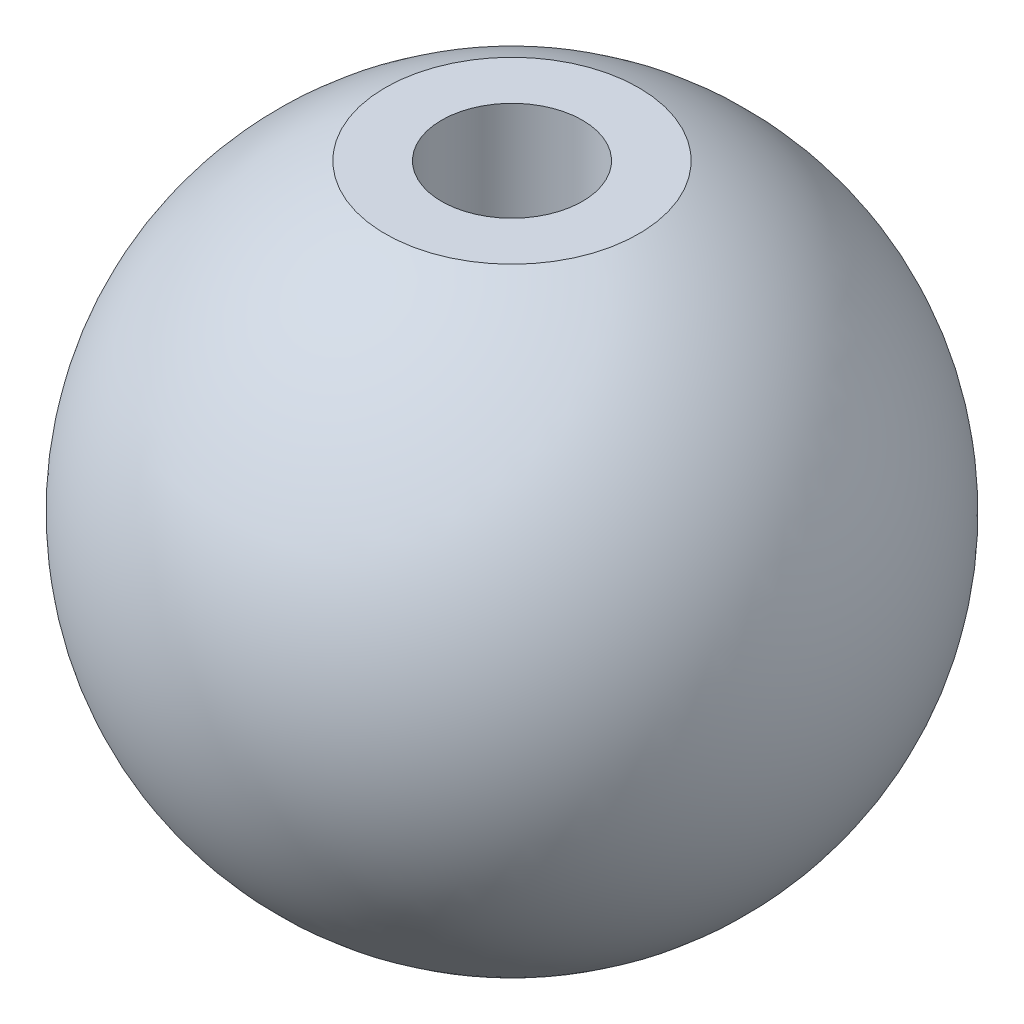
ISO-10303-21;
HEADER;
FILE_DESCRIPTION(('STEP AP214'),'2;1');
FILE_NAME('part.step','',(''),(''),'','','');
FILE_SCHEMA(('AUTOMOTIVE_DESIGN { 1 0 10303 214 1 1 1 1 }'));
ENDSEC;
DATA;
#1=APPLICATION_CONTEXT('core data for automotive mechanical design processes');
#2=APPLICATION_PROTOCOL_DEFINITION('international standard','automotive_design',2000,#1);
#3=PRODUCT_CONTEXT('',#1,'mechanical');
#4=PRODUCT('Part','Part','',(#3));
#5=PRODUCT_RELATED_PRODUCT_CATEGORY('part','',(#4));
#6=PRODUCT_DEFINITION_FORMATION('','',#4);
#7=PRODUCT_DEFINITION_CONTEXT('part definition',#1,'design');
#8=PRODUCT_DEFINITION('design','',#6,#7);
#9=PRODUCT_DEFINITION_SHAPE('','',#8);
#10=(LENGTH_UNIT() NAMED_UNIT(*) SI_UNIT(.MILLI.,.METRE.));
#11=(NAMED_UNIT(*) PLANE_ANGLE_UNIT() SI_UNIT($,.RADIAN.));
#12=(NAMED_UNIT(*) SI_UNIT($,.STERADIAN.) SOLID_ANGLE_UNIT());
#13=UNCERTAINTY_MEASURE_WITH_UNIT(LENGTH_MEASURE(1.E-05),#10,'distance_accuracy_value','');
#14=(GEOMETRIC_REPRESENTATION_CONTEXT(3) GLOBAL_UNCERTAINTY_ASSIGNED_CONTEXT((#13)) GLOBAL_UNIT_ASSIGNED_CONTEXT((#10,
#11,#12)) REPRESENTATION_CONTEXT('',''));
#15=CARTESIAN_POINT('',(0.,0.,0.));
#16=DIRECTION('',(0.,0.,1.));
#17=DIRECTION('',(1.,0.,0.));
#18=AXIS2_PLACEMENT_3D('',#15,#16,#17);
#19=CARTESIAN_POINT('',(0.,-12.2949152542373,0.));
#20=DIRECTION('',(0.,1.,0.));
#21=DIRECTION('',(0.,0.,1.));
#22=AXIS2_PLACEMENT_3D('',#19,#20,#21);
#23=CYLINDRICAL_SURFACE('',#22,2.5);
#24=CARTESIAN_POINT('',(0.,-11.3949152542373,0.));
#25=DIRECTION('',(0.,1.,0.));
#26=DIRECTION('',(-1.,0.,0.));
#27=AXIS2_PLACEMENT_3D('',#24,#25,#26);
#28=CIRCLE('',#27,2.5);
#29=CARTESIAN_POINT('',(-2.5,-11.3949152542373,0.));
#30=VERTEX_POINT('',#29);
#31=EDGE_CURVE('E47',#30,#30,#28,.F.);
#32=ORIENTED_EDGE('',*,*,#31,.T.);
#33=EDGE_LOOP('',(#32));
#34=FACE_BOUND('',#33,.T.);
#35=CARTESIAN_POINT('',(0.,10.2050847457627,0.));
#36=DIRECTION('',(0.,-1.,0.));
#37=DIRECTION('',(0.,0.,-1.));
#38=AXIS2_PLACEMENT_3D('',#35,#36,#37);
#39=CIRCLE('',#38,2.5);
#40=CARTESIAN_POINT('',(0.,10.2050847457627,-2.5));
#41=VERTEX_POINT('',#40);
#42=EDGE_CURVE('E59',#41,#41,#39,.F.);
#43=ORIENTED_EDGE('',*,*,#42,.T.);
#44=EDGE_LOOP('',(#43));
#45=FACE_BOUND('',#44,.T.);
#46=ADVANCED_FACE('F43',(#34,#45),#23,.F.);
#47=CARTESIAN_POINT('',(-13.7685867700049,10.2050847457627,-11.7));
#48=DIRECTION('',(0.,-1.,0.));
#49=DIRECTION('',(0.,0.,-1.));
#50=AXIS2_PLACEMENT_3D('',#47,#48,#49);
#51=PLANE('',#50);
#52=CARTESIAN_POINT('',(0.,10.2050847457627,0.));
#53=DIRECTION('',(0.,-1.,0.));
#54=DIRECTION('',(0.,0.,-1.));
#55=AXIS2_PLACEMENT_3D('',#52,#53,#54);
#56=CIRCLE('',#55,4.5);
#57=CARTESIAN_POINT('',(0.,10.2050847457627,-4.5));
#58=VERTEX_POINT('',#57);
#59=EDGE_CURVE('E57',#58,#58,#56,.F.);
#60=ORIENTED_EDGE('',*,*,#59,.T.);
#61=EDGE_LOOP('',(#60));
#62=FACE_BOUND('',#61,.T.);
#63=ORIENTED_EDGE('',*,*,#42,.F.);
#64=EDGE_LOOP('',(#63));
#65=FACE_BOUND('',#64,.T.);
#66=ADVANCED_FACE('F68',(#62,#65),#51,.F.);
#67=CARTESIAN_POINT('',(12.6312566988906,-11.3949152542373,-11.7));
#68=DIRECTION('',(0.,1.,0.));
#69=DIRECTION('',(-1.,0.,0.));
#70=AXIS2_PLACEMENT_3D('',#67,#68,#69);
#71=PLANE('',#70);
#72=CARTESIAN_POINT('',(0.,-11.3949152542373,0.));
#73=DIRECTION('',(0.,1.,0.));
#74=DIRECTION('',(-1.,0.,0.));
#75=AXIS2_PLACEMENT_3D('',#72,#73,#74);
#76=CIRCLE('',#75,4.49999999999999);
#77=CARTESIAN_POINT('',(-4.49999999999999,-11.3949152542373,0.));
#78=VERTEX_POINT('',#77);
#79=EDGE_CURVE('E10',#78,#78,#76,.F.);
#80=ORIENTED_EDGE('',*,*,#79,.T.);
#81=EDGE_LOOP('',(#80));
#82=FACE_BOUND('',#81,.T.);
#83=ORIENTED_EDGE('',*,*,#31,.F.);
#84=EDGE_LOOP('',(#83));
#85=FACE_BOUND('',#84,.T.);
#86=ADVANCED_FACE('F72',(#82,#85),#71,.F.);
#87=CARTESIAN_POINT('',(0.,-0.594915254237287,0.));
#88=DIRECTION('',(0.,1.,0.));
#89=DIRECTION('',(-1.,0.,0.));
#90=AXIS2_PLACEMENT_3D('',#87,#88,#89);
#91=SPHERICAL_SURFACE('',#90,11.7);
#92=ORIENTED_EDGE('',*,*,#79,.F.);
#93=EDGE_LOOP('',(#92));
#94=FACE_BOUND('',#93,.T.);
#95=ORIENTED_EDGE('',*,*,#59,.F.);
#96=EDGE_LOOP('',(#95));
#97=FACE_BOUND('',#96,.T.);
#98=ADVANCED_FACE('F45',(#94,#97),#91,.T.);
#99=CLOSED_SHELL('',(#46,#66,#86,#98));
#100=MANIFOLD_SOLID_BREP('B2',#99);
#101=ADVANCED_BREP_SHAPE_REPRESENTATION('',(#18,#100),#14);
#102=SHAPE_DEFINITION_REPRESENTATION(#9,#101);
ENDSEC;
END-ISO-10303-21;
